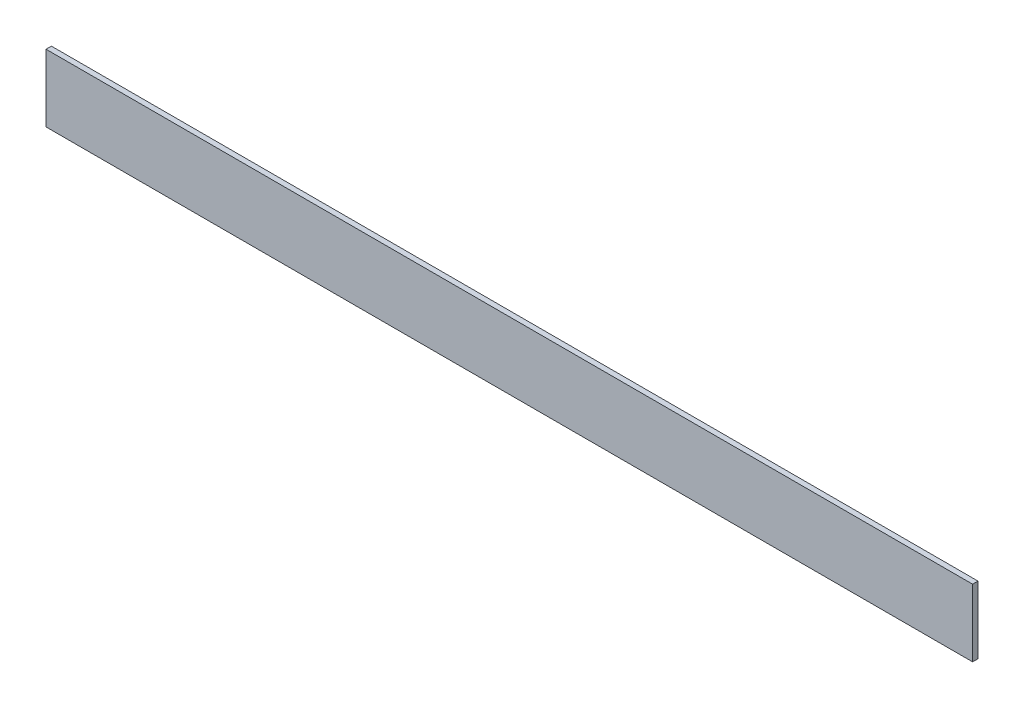
ISO-10303-21;
HEADER;
FILE_DESCRIPTION(('STEP AP214'),'2;1');
FILE_NAME('part.step','',(''),(''),'','','');
FILE_SCHEMA(('AUTOMOTIVE_DESIGN { 1 0 10303 214 1 1 1 1 }'));
ENDSEC;
DATA;
#1=APPLICATION_CONTEXT('core data for automotive mechanical design processes');
#2=APPLICATION_PROTOCOL_DEFINITION('international standard','automotive_design',2000,#1);
#3=PRODUCT_CONTEXT('',#1,'mechanical');
#4=PRODUCT('Part','Part','',(#3));
#5=PRODUCT_RELATED_PRODUCT_CATEGORY('part','',(#4));
#6=PRODUCT_DEFINITION_FORMATION('','',#4);
#7=PRODUCT_DEFINITION_CONTEXT('part definition',#1,'design');
#8=PRODUCT_DEFINITION('design','',#6,#7);
#9=PRODUCT_DEFINITION_SHAPE('','',#8);
#10=(LENGTH_UNIT() NAMED_UNIT(*) SI_UNIT(.MILLI.,.METRE.));
#11=(NAMED_UNIT(*) PLANE_ANGLE_UNIT() SI_UNIT($,.RADIAN.));
#12=(NAMED_UNIT(*) SI_UNIT($,.STERADIAN.) SOLID_ANGLE_UNIT());
#13=UNCERTAINTY_MEASURE_WITH_UNIT(LENGTH_MEASURE(1.E-05),#10,'distance_accuracy_value','');
#14=(GEOMETRIC_REPRESENTATION_CONTEXT(3) GLOBAL_UNCERTAINTY_ASSIGNED_CONTEXT((#13)) GLOBAL_UNIT_ASSIGNED_CONTEXT((#10,
#11,#12)) REPRESENTATION_CONTEXT('',''));
#15=CARTESIAN_POINT('',(0.,0.,0.));
#16=DIRECTION('',(0.,0.,1.));
#17=DIRECTION('',(1.,0.,0.));
#18=AXIS2_PLACEMENT_3D('',#15,#16,#17);
#19=CARTESIAN_POINT('',(344.2,0.,0.));
#20=DIRECTION('',(0.,0.,-1.));
#21=DIRECTION('',(-1.,0.,0.));
#22=AXIS2_PLACEMENT_3D('',#19,#20,#21);
#23=PLANE('',#22);
#24=DIRECTION('',(0.,-1.,0.));
#25=VECTOR('',#24,1.);
#26=CARTESIAN_POINT('',(0.,0.,0.));
#27=LINE('',#26,#25);
#28=CARTESIAN_POINT('',(0.,25.,0.));
#29=VERTEX_POINT('',#28);
#30=CARTESIAN_POINT('',(0.,0.,0.));
#31=VERTEX_POINT('',#30);
#32=EDGE_CURVE('E98',#29,#31,#27,.T.);
#33=ORIENTED_EDGE('',*,*,#32,.T.);
#34=DIRECTION('',(-1.,0.,0.));
#35=VECTOR('',#34,1.);
#36=CARTESIAN_POINT('',(344.2,0.,0.));
#37=LINE('',#36,#35);
#38=CARTESIAN_POINT('',(344.2,0.,0.));
#39=VERTEX_POINT('',#38);
#40=EDGE_CURVE('E11',#39,#31,#37,.T.);
#41=ORIENTED_EDGE('',*,*,#40,.F.);
#42=DIRECTION('',(0.,-1.,0.));
#43=VECTOR('',#42,1.);
#44=CARTESIAN_POINT('',(344.2,0.,0.));
#45=LINE('',#44,#43);
#46=CARTESIAN_POINT('',(344.2,25.,0.));
#47=VERTEX_POINT('',#46);
#48=EDGE_CURVE('E86',#47,#39,#45,.T.);
#49=ORIENTED_EDGE('',*,*,#48,.F.);
#50=DIRECTION('',(-1.,0.,0.));
#51=VECTOR('',#50,1.);
#52=CARTESIAN_POINT('',(344.2,25.,0.));
#53=LINE('',#52,#51);
#54=EDGE_CURVE('E94',#47,#29,#53,.T.);
#55=ORIENTED_EDGE('',*,*,#54,.T.);
#56=EDGE_LOOP('',(#33,#41,#49,#55));
#57=FACE_BOUND('',#56,.T.);
#58=ADVANCED_FACE('F35',(#57),#23,.F.);
#59=CARTESIAN_POINT('',(344.2,0.,0.));
#60=DIRECTION('',(0.,1.,0.));
#61=DIRECTION('',(0.,0.,1.));
#62=AXIS2_PLACEMENT_3D('',#59,#60,#61);
#63=PLANE('',#62);
#64=DIRECTION('',(0.,0.,-1.));
#65=VECTOR('',#64,1.);
#66=CARTESIAN_POINT('',(0.,0.,0.));
#67=LINE('',#66,#65);
#68=CARTESIAN_POINT('',(0.,0.,-2.));
#69=VERTEX_POINT('',#68);
#70=EDGE_CURVE('E90',#31,#69,#67,.T.);
#71=ORIENTED_EDGE('',*,*,#70,.T.);
#72=DIRECTION('',(-1.,0.,0.));
#73=VECTOR('',#72,1.);
#74=CARTESIAN_POINT('',(344.2,0.,-2.));
#75=LINE('',#74,#73);
#76=CARTESIAN_POINT('',(344.2,0.,-2.));
#77=VERTEX_POINT('',#76);
#78=EDGE_CURVE('E43',#77,#69,#75,.T.);
#79=ORIENTED_EDGE('',*,*,#78,.F.);
#80=DIRECTION('',(0.,0.,-1.));
#81=VECTOR('',#80,1.);
#82=CARTESIAN_POINT('',(344.2,0.,0.));
#83=LINE('',#82,#81);
#84=EDGE_CURVE('E81',#39,#77,#83,.T.);
#85=ORIENTED_EDGE('',*,*,#84,.F.);
#86=ORIENTED_EDGE('',*,*,#40,.T.);
#87=EDGE_LOOP('',(#71,#79,#85,#86));
#88=FACE_BOUND('',#87,.T.);
#89=ADVANCED_FACE('F89',(#88),#63,.F.);
#90=CARTESIAN_POINT('',(344.2,0.,-2.));
#91=DIRECTION('',(0.,0.,1.));
#92=DIRECTION('',(1.,0.,0.));
#93=AXIS2_PLACEMENT_3D('',#90,#91,#92);
#94=PLANE('',#93);
#95=DIRECTION('',(0.,1.,0.));
#96=VECTOR('',#95,1.);
#97=CARTESIAN_POINT('',(0.,0.,-2.));
#98=LINE('',#97,#96);
#99=CARTESIAN_POINT('',(0.,25.,-2.));
#100=VERTEX_POINT('',#99);
#101=EDGE_CURVE('E68',#69,#100,#98,.T.);
#102=ORIENTED_EDGE('',*,*,#101,.T.);
#103=DIRECTION('',(-1.,0.,0.));
#104=VECTOR('',#103,1.);
#105=CARTESIAN_POINT('',(344.2,25.,-2.));
#106=LINE('',#105,#104);
#107=CARTESIAN_POINT('',(344.2,25.,-2.));
#108=VERTEX_POINT('',#107);
#109=EDGE_CURVE('E91',#108,#100,#106,.T.);
#110=ORIENTED_EDGE('',*,*,#109,.F.);
#111=DIRECTION('',(0.,1.,0.));
#112=VECTOR('',#111,1.);
#113=CARTESIAN_POINT('',(344.2,0.,-2.));
#114=LINE('',#113,#112);
#115=EDGE_CURVE('E84',#77,#108,#114,.T.);
#116=ORIENTED_EDGE('',*,*,#115,.F.);
#117=ORIENTED_EDGE('',*,*,#78,.T.);
#118=EDGE_LOOP('',(#102,#110,#116,#117));
#119=FACE_BOUND('',#118,.T.);
#120=ADVANCED_FACE('F92',(#119),#94,.F.);
#121=CARTESIAN_POINT('',(344.2,25.,0.));
#122=DIRECTION('',(0.,-1.,0.));
#123=DIRECTION('',(0.,0.,-1.));
#124=AXIS2_PLACEMENT_3D('',#121,#122,#123);
#125=PLANE('',#124);
#126=DIRECTION('',(0.,0.,1.));
#127=VECTOR('',#126,1.);
#128=CARTESIAN_POINT('',(0.,25.,0.));
#129=LINE('',#128,#127);
#130=EDGE_CURVE('E74',#100,#29,#129,.T.);
#131=ORIENTED_EDGE('',*,*,#130,.T.);
#132=ORIENTED_EDGE('',*,*,#54,.F.);
#133=DIRECTION('',(0.,0.,1.));
#134=VECTOR('',#133,1.);
#135=CARTESIAN_POINT('',(344.2,25.,0.));
#136=LINE('',#135,#134);
#137=EDGE_CURVE('E51',#108,#47,#136,.T.);
#138=ORIENTED_EDGE('',*,*,#137,.F.);
#139=ORIENTED_EDGE('',*,*,#109,.T.);
#140=EDGE_LOOP('',(#131,#132,#138,#139));
#141=FACE_BOUND('',#140,.T.);
#142=ADVANCED_FACE('F105',(#141),#125,.F.);
#143=CARTESIAN_POINT('',(344.2,0.,0.));
#144=DIRECTION('',(-1.,0.,0.));
#145=DIRECTION('',(0.,0.,1.));
#146=AXIS2_PLACEMENT_3D('',#143,#144,#145);
#147=PLANE('',#146);
#148=ORIENTED_EDGE('',*,*,#48,.T.);
#149=ORIENTED_EDGE('',*,*,#84,.T.);
#150=ORIENTED_EDGE('',*,*,#115,.T.);
#151=ORIENTED_EDGE('',*,*,#137,.T.);
#152=EDGE_LOOP('',(#148,#149,#150,#151));
#153=FACE_BOUND('',#152,.T.);
#154=ADVANCED_FACE('F82',(#153),#147,.F.);
#155=CARTESIAN_POINT('',(0.,0.,0.));
#156=DIRECTION('',(-1.,0.,0.));
#157=DIRECTION('',(0.,0.,1.));
#158=AXIS2_PLACEMENT_3D('',#155,#156,#157);
#159=PLANE('',#158);
#160=ORIENTED_EDGE('',*,*,#32,.F.);
#161=ORIENTED_EDGE('',*,*,#130,.F.);
#162=ORIENTED_EDGE('',*,*,#101,.F.);
#163=ORIENTED_EDGE('',*,*,#70,.F.);
#164=EDGE_LOOP('',(#160,#161,#162,#163));
#165=FACE_BOUND('',#164,.T.);
#166=ADVANCED_FACE('F108',(#165),#159,.T.);
#167=CLOSED_SHELL('',(#58,#89,#120,#142,#154,#166));
#168=MANIFOLD_SOLID_BREP('B2',#167);
#169=ADVANCED_BREP_SHAPE_REPRESENTATION('',(#18,#168),#14);
#170=SHAPE_DEFINITION_REPRESENTATION(#9,#169);
ENDSEC;
END-ISO-10303-21;
